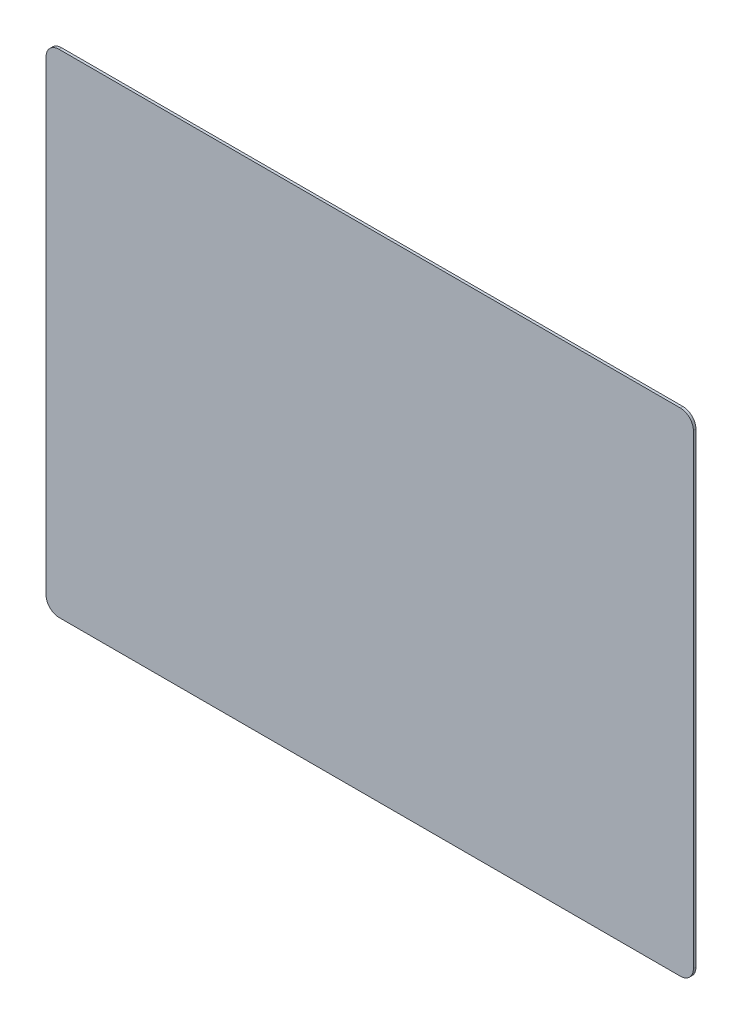
ISO-10303-21;
HEADER;
FILE_DESCRIPTION(('STEP AP214'),'2;1');
FILE_NAME('part.step','',(''),(''),'','','');
FILE_SCHEMA(('AUTOMOTIVE_DESIGN { 1 0 10303 214 1 1 1 1 }'));
ENDSEC;
DATA;
#1=APPLICATION_CONTEXT('core data for automotive mechanical design processes');
#2=APPLICATION_PROTOCOL_DEFINITION('international standard','automotive_design',2000,#1);
#3=PRODUCT_CONTEXT('',#1,'mechanical');
#4=PRODUCT('Part','Part','',(#3));
#5=PRODUCT_RELATED_PRODUCT_CATEGORY('part','',(#4));
#6=PRODUCT_DEFINITION_FORMATION('','',#4);
#7=PRODUCT_DEFINITION_CONTEXT('part definition',#1,'design');
#8=PRODUCT_DEFINITION('design','',#6,#7);
#9=PRODUCT_DEFINITION_SHAPE('','',#8);
#10=(LENGTH_UNIT() NAMED_UNIT(*) SI_UNIT(.MILLI.,.METRE.));
#11=(NAMED_UNIT(*) PLANE_ANGLE_UNIT() SI_UNIT($,.RADIAN.));
#12=(NAMED_UNIT(*) SI_UNIT($,.STERADIAN.) SOLID_ANGLE_UNIT());
#13=UNCERTAINTY_MEASURE_WITH_UNIT(LENGTH_MEASURE(1.E-05),#10,'distance_accuracy_value','');
#14=(GEOMETRIC_REPRESENTATION_CONTEXT(3) GLOBAL_UNCERTAINTY_ASSIGNED_CONTEXT((#13)) GLOBAL_UNIT_ASSIGNED_CONTEXT((#10,
#11,#12)) REPRESENTATION_CONTEXT('',''));
#15=CARTESIAN_POINT('',(0.,0.,0.));
#16=DIRECTION('',(0.,0.,1.));
#17=DIRECTION('',(1.,0.,0.));
#18=AXIS2_PLACEMENT_3D('',#15,#16,#17);
#19=CARTESIAN_POINT('',(498.5,-379.,4.));
#20=DIRECTION('',(-1.,0.,0.));
#21=DIRECTION('',(0.,0.,1.));
#22=AXIS2_PLACEMENT_3D('',#19,#20,#21);
#23=PLANE('',#22);
#24=DIRECTION('',(0.,1.,0.));
#25=VECTOR('',#24,1.);
#26=CARTESIAN_POINT('',(498.5,-379.,0.));
#27=LINE('',#26,#25);
#28=CARTESIAN_POINT('',(498.5,-359.,0.));
#29=VERTEX_POINT('',#28);
#30=CARTESIAN_POINT('',(498.5,359.,0.));
#31=VERTEX_POINT('',#30);
#32=EDGE_CURVE('E157',#29,#31,#27,.T.);
#33=ORIENTED_EDGE('',*,*,#32,.T.);
#34=DIRECTION('',(0.,0.,-1.));
#35=VECTOR('',#34,1.);
#36=CARTESIAN_POINT('',(498.5,359.,4.));
#37=LINE('',#36,#35);
#38=CARTESIAN_POINT('',(498.5,359.,4.));
#39=VERTEX_POINT('',#38);
#40=EDGE_CURVE('E11',#31,#39,#37,.F.);
#41=ORIENTED_EDGE('',*,*,#40,.T.);
#42=DIRECTION('',(0.,1.,0.));
#43=VECTOR('',#42,1.);
#44=CARTESIAN_POINT('',(498.5,-379.,4.));
#45=LINE('',#44,#43);
#46=CARTESIAN_POINT('',(498.5,-359.,4.));
#47=VERTEX_POINT('',#46);
#48=EDGE_CURVE('E125',#47,#39,#45,.T.);
#49=ORIENTED_EDGE('',*,*,#48,.F.);
#50=DIRECTION('',(0.,0.,-1.));
#51=VECTOR('',#50,1.);
#52=CARTESIAN_POINT('',(498.5,-359.,4.));
#53=LINE('',#52,#51);
#54=EDGE_CURVE('E41',#47,#29,#53,.T.);
#55=ORIENTED_EDGE('',*,*,#54,.T.);
#56=EDGE_LOOP('',(#33,#41,#49,#55));
#57=FACE_BOUND('',#56,.T.);
#58=ADVANCED_FACE('F33',(#57),#23,.F.);
#59=CARTESIAN_POINT('',(-498.5,379.,4.));
#60=DIRECTION('',(0.,-1.,0.));
#61=DIRECTION('',(0.,0.,-1.));
#62=AXIS2_PLACEMENT_3D('',#59,#60,#61);
#63=PLANE('',#62);
#64=DIRECTION('',(-1.,0.,0.));
#65=VECTOR('',#64,1.);
#66=CARTESIAN_POINT('',(-498.5,379.,0.));
#67=LINE('',#66,#65);
#68=CARTESIAN_POINT('',(478.5,379.,0.));
#69=VERTEX_POINT('',#68);
#70=CARTESIAN_POINT('',(-478.5,379.,0.));
#71=VERTEX_POINT('',#70);
#72=EDGE_CURVE('E130',#69,#71,#67,.T.);
#73=ORIENTED_EDGE('',*,*,#72,.T.);
#74=DIRECTION('',(0.,0.,-1.));
#75=VECTOR('',#74,1.);
#76=CARTESIAN_POINT('',(-478.5,379.,4.));
#77=LINE('',#76,#75);
#78=CARTESIAN_POINT('',(-478.5,379.,4.));
#79=VERTEX_POINT('',#78);
#80=EDGE_CURVE('E48',#71,#79,#77,.F.);
#81=ORIENTED_EDGE('',*,*,#80,.T.);
#82=DIRECTION('',(-1.,0.,0.));
#83=VECTOR('',#82,1.);
#84=CARTESIAN_POINT('',(-498.5,379.,4.));
#85=LINE('',#84,#83);
#86=CARTESIAN_POINT('',(478.5,379.,4.));
#87=VERTEX_POINT('',#86);
#88=EDGE_CURVE('E128',#87,#79,#85,.T.);
#89=ORIENTED_EDGE('',*,*,#88,.F.);
#90=DIRECTION('',(0.,0.,-1.));
#91=VECTOR('',#90,1.);
#92=CARTESIAN_POINT('',(478.5,379.,4.));
#93=LINE('',#92,#91);
#94=EDGE_CURVE('E149',#87,#69,#93,.T.);
#95=ORIENTED_EDGE('',*,*,#94,.T.);
#96=EDGE_LOOP('',(#73,#81,#89,#95));
#97=FACE_BOUND('',#96,.T.);
#98=ADVANCED_FACE('F177',(#97),#63,.F.);
#99=CARTESIAN_POINT('',(-498.5,-379.,4.));
#100=DIRECTION('',(1.,0.,0.));
#101=DIRECTION('',(0.,0.,-1.));
#102=AXIS2_PLACEMENT_3D('',#99,#100,#101);
#103=PLANE('',#102);
#104=DIRECTION('',(0.,-1.,0.));
#105=VECTOR('',#104,1.);
#106=CARTESIAN_POINT('',(-498.5,-379.,0.));
#107=LINE('',#106,#105);
#108=CARTESIAN_POINT('',(-498.5,359.,0.));
#109=VERTEX_POINT('',#108);
#110=CARTESIAN_POINT('',(-498.5,-359.,0.));
#111=VERTEX_POINT('',#110);
#112=EDGE_CURVE('E126',#109,#111,#107,.T.);
#113=ORIENTED_EDGE('',*,*,#112,.T.);
#114=DIRECTION('',(0.,0.,-1.));
#115=VECTOR('',#114,1.);
#116=CARTESIAN_POINT('',(-498.5,-359.,4.));
#117=LINE('',#116,#115);
#118=CARTESIAN_POINT('',(-498.5,-359.,4.));
#119=VERTEX_POINT('',#118);
#120=EDGE_CURVE('E104',#111,#119,#117,.F.);
#121=ORIENTED_EDGE('',*,*,#120,.T.);
#122=DIRECTION('',(0.,-1.,0.));
#123=VECTOR('',#122,1.);
#124=CARTESIAN_POINT('',(-498.5,-379.,4.));
#125=LINE('',#124,#123);
#126=CARTESIAN_POINT('',(-498.5,359.,4.));
#127=VERTEX_POINT('',#126);
#128=EDGE_CURVE('E165',#127,#119,#125,.T.);
#129=ORIENTED_EDGE('',*,*,#128,.F.);
#130=DIRECTION('',(0.,0.,-1.));
#131=VECTOR('',#130,1.);
#132=CARTESIAN_POINT('',(-498.5,359.,4.));
#133=LINE('',#132,#131);
#134=EDGE_CURVE('E109',#127,#109,#133,.T.);
#135=ORIENTED_EDGE('',*,*,#134,.T.);
#136=EDGE_LOOP('',(#113,#121,#129,#135));
#137=FACE_BOUND('',#136,.T.);
#138=ADVANCED_FACE('F176',(#137),#103,.F.);
#139=CARTESIAN_POINT('',(-498.5,-379.,4.));
#140=DIRECTION('',(0.,1.,0.));
#141=DIRECTION('',(0.,0.,1.));
#142=AXIS2_PLACEMENT_3D('',#139,#140,#141);
#143=PLANE('',#142);
#144=DIRECTION('',(1.,0.,0.));
#145=VECTOR('',#144,1.);
#146=CARTESIAN_POINT('',(-498.5,-379.,4.));
#147=LINE('',#146,#145);
#148=CARTESIAN_POINT('',(-478.5,-379.,4.));
#149=VERTEX_POINT('',#148);
#150=CARTESIAN_POINT('',(478.5,-379.,4.));
#151=VERTEX_POINT('',#150);
#152=EDGE_CURVE('E119',#149,#151,#147,.T.);
#153=ORIENTED_EDGE('',*,*,#152,.F.);
#154=DIRECTION('',(0.,0.,-1.));
#155=VECTOR('',#154,1.);
#156=CARTESIAN_POINT('',(-478.5,-379.,4.));
#157=LINE('',#156,#155);
#158=CARTESIAN_POINT('',(-478.5,-379.,0.));
#159=VERTEX_POINT('',#158);
#160=EDGE_CURVE('E103',#149,#159,#157,.T.);
#161=ORIENTED_EDGE('',*,*,#160,.T.);
#162=DIRECTION('',(1.,0.,0.));
#163=VECTOR('',#162,1.);
#164=CARTESIAN_POINT('',(-498.5,-379.,0.));
#165=LINE('',#164,#163);
#166=CARTESIAN_POINT('',(478.5,-379.,0.));
#167=VERTEX_POINT('',#166);
#168=EDGE_CURVE('E116',#159,#167,#165,.T.);
#169=ORIENTED_EDGE('',*,*,#168,.T.);
#170=DIRECTION('',(0.,0.,-1.));
#171=VECTOR('',#170,1.);
#172=CARTESIAN_POINT('',(478.5,-379.,4.));
#173=LINE('',#172,#171);
#174=EDGE_CURVE('E121',#167,#151,#173,.F.);
#175=ORIENTED_EDGE('',*,*,#174,.T.);
#176=EDGE_LOOP('',(#153,#161,#169,#175));
#177=FACE_BOUND('',#176,.T.);
#178=ADVANCED_FACE('F115',(#177),#143,.F.);
#179=CARTESIAN_POINT('',(0.,0.,4.));
#180=DIRECTION('',(0.,0.,-1.));
#181=DIRECTION('',(-1.,0.,0.));
#182=AXIS2_PLACEMENT_3D('',#179,#180,#181);
#183=PLANE('',#182);
#184=ORIENTED_EDGE('',*,*,#128,.T.);
#185=CARTESIAN_POINT('',(-478.5,-359.,4.));
#186=DIRECTION('',(0.,0.,-1.));
#187=DIRECTION('',(-1.,0.,0.));
#188=AXIS2_PLACEMENT_3D('',#185,#186,#187);
#189=CIRCLE('',#188,20.);
#190=EDGE_CURVE('E147',#119,#149,#189,.F.);
#191=ORIENTED_EDGE('',*,*,#190,.T.);
#192=ORIENTED_EDGE('',*,*,#152,.T.);
#193=CARTESIAN_POINT('',(478.5,-359.,4.));
#194=DIRECTION('',(0.,0.,-1.));
#195=DIRECTION('',(-1.,0.,0.));
#196=AXIS2_PLACEMENT_3D('',#193,#194,#195);
#197=CIRCLE('',#196,20.);
#198=EDGE_CURVE('E142',#151,#47,#197,.F.);
#199=ORIENTED_EDGE('',*,*,#198,.T.);
#200=ORIENTED_EDGE('',*,*,#48,.T.);
#201=CARTESIAN_POINT('',(478.5,359.,4.));
#202=DIRECTION('',(0.,0.,-1.));
#203=DIRECTION('',(-1.,0.,0.));
#204=AXIS2_PLACEMENT_3D('',#201,#202,#203);
#205=CIRCLE('',#204,20.);
#206=EDGE_CURVE('E55',#39,#87,#205,.F.);
#207=ORIENTED_EDGE('',*,*,#206,.T.);
#208=ORIENTED_EDGE('',*,*,#88,.T.);
#209=CARTESIAN_POINT('',(-478.5,359.,4.));
#210=DIRECTION('',(0.,0.,-1.));
#211=DIRECTION('',(-1.,0.,0.));
#212=AXIS2_PLACEMENT_3D('',#209,#210,#211);
#213=CIRCLE('',#212,20.);
#214=EDGE_CURVE('E145',#79,#127,#213,.F.);
#215=ORIENTED_EDGE('',*,*,#214,.T.);
#216=EDGE_LOOP('',(#184,#191,#192,#199,#200,#207,#208,#215));
#217=FACE_BOUND('',#216,.T.);
#218=ADVANCED_FACE('F169',(#217),#183,.F.);
#219=CARTESIAN_POINT('',(0.,0.,0.));
#220=DIRECTION('',(0.,0.,-1.));
#221=DIRECTION('',(-1.,0.,0.));
#222=AXIS2_PLACEMENT_3D('',#219,#220,#221);
#223=PLANE('',#222);
#224=ORIENTED_EDGE('',*,*,#168,.F.);
#225=CARTESIAN_POINT('',(-478.5,-359.,0.));
#226=DIRECTION('',(0.,0.,-1.));
#227=DIRECTION('',(-1.,0.,0.));
#228=AXIS2_PLACEMENT_3D('',#225,#226,#227);
#229=CIRCLE('',#228,20.);
#230=EDGE_CURVE('E99',#159,#111,#229,.T.);
#231=ORIENTED_EDGE('',*,*,#230,.T.);
#232=ORIENTED_EDGE('',*,*,#112,.F.);
#233=CARTESIAN_POINT('',(-478.5,359.,0.));
#234=DIRECTION('',(0.,0.,-1.));
#235=DIRECTION('',(-1.,0.,0.));
#236=AXIS2_PLACEMENT_3D('',#233,#234,#235);
#237=CIRCLE('',#236,20.);
#238=EDGE_CURVE('E110',#109,#71,#237,.T.);
#239=ORIENTED_EDGE('',*,*,#238,.T.);
#240=ORIENTED_EDGE('',*,*,#72,.F.);
#241=CARTESIAN_POINT('',(478.5,359.,0.));
#242=DIRECTION('',(0.,0.,-1.));
#243=DIRECTION('',(-1.,0.,0.));
#244=AXIS2_PLACEMENT_3D('',#241,#242,#243);
#245=CIRCLE('',#244,20.);
#246=EDGE_CURVE('E136',#69,#31,#245,.T.);
#247=ORIENTED_EDGE('',*,*,#246,.T.);
#248=ORIENTED_EDGE('',*,*,#32,.F.);
#249=CARTESIAN_POINT('',(478.5,-359.,0.));
#250=DIRECTION('',(0.,0.,-1.));
#251=DIRECTION('',(-1.,0.,0.));
#252=AXIS2_PLACEMENT_3D('',#249,#250,#251);
#253=CIRCLE('',#252,20.);
#254=EDGE_CURVE('E120',#29,#167,#253,.T.);
#255=ORIENTED_EDGE('',*,*,#254,.T.);
#256=EDGE_LOOP('',(#224,#231,#232,#239,#240,#247,#248,#255));
#257=FACE_BOUND('',#256,.T.);
#258=ADVANCED_FACE('F123',(#257),#223,.T.);
#259=CARTESIAN_POINT('',(-478.5,-359.,4.));
#260=DIRECTION('',(0.,0.,-1.));
#261=DIRECTION('',(-1.,0.,0.));
#262=AXIS2_PLACEMENT_3D('',#259,#260,#261);
#263=CYLINDRICAL_SURFACE('',#262,20.);
#264=ORIENTED_EDGE('',*,*,#190,.F.);
#265=ORIENTED_EDGE('',*,*,#120,.F.);
#266=ORIENTED_EDGE('',*,*,#230,.F.);
#267=ORIENTED_EDGE('',*,*,#160,.F.);
#268=EDGE_LOOP('',(#264,#265,#266,#267));
#269=FACE_BOUND('',#268,.T.);
#270=ADVANCED_FACE('F102',(#269),#263,.T.);
#271=CARTESIAN_POINT('',(-478.5,359.,4.));
#272=DIRECTION('',(0.,0.,-1.));
#273=DIRECTION('',(-1.,0.,0.));
#274=AXIS2_PLACEMENT_3D('',#271,#272,#273);
#275=CYLINDRICAL_SURFACE('',#274,20.);
#276=ORIENTED_EDGE('',*,*,#214,.F.);
#277=ORIENTED_EDGE('',*,*,#80,.F.);
#278=ORIENTED_EDGE('',*,*,#238,.F.);
#279=ORIENTED_EDGE('',*,*,#134,.F.);
#280=EDGE_LOOP('',(#276,#277,#278,#279));
#281=FACE_BOUND('',#280,.T.);
#282=ADVANCED_FACE('F174',(#281),#275,.T.);
#283=CARTESIAN_POINT('',(478.5,359.,4.));
#284=DIRECTION('',(0.,0.,-1.));
#285=DIRECTION('',(-1.,0.,0.));
#286=AXIS2_PLACEMENT_3D('',#283,#284,#285);
#287=CYLINDRICAL_SURFACE('',#286,20.);
#288=ORIENTED_EDGE('',*,*,#206,.F.);
#289=ORIENTED_EDGE('',*,*,#40,.F.);
#290=ORIENTED_EDGE('',*,*,#246,.F.);
#291=ORIENTED_EDGE('',*,*,#94,.F.);
#292=EDGE_LOOP('',(#288,#289,#290,#291));
#293=FACE_BOUND('',#292,.T.);
#294=ADVANCED_FACE('F179',(#293),#287,.T.);
#295=CARTESIAN_POINT('',(478.5,-359.,4.));
#296=DIRECTION('',(0.,0.,-1.));
#297=DIRECTION('',(-1.,0.,0.));
#298=AXIS2_PLACEMENT_3D('',#295,#296,#297);
#299=CYLINDRICAL_SURFACE('',#298,20.);
#300=ORIENTED_EDGE('',*,*,#198,.F.);
#301=ORIENTED_EDGE('',*,*,#174,.F.);
#302=ORIENTED_EDGE('',*,*,#254,.F.);
#303=ORIENTED_EDGE('',*,*,#54,.F.);
#304=EDGE_LOOP('',(#300,#301,#302,#303));
#305=FACE_BOUND('',#304,.T.);
#306=ADVANCED_FACE('F35',(#305),#299,.T.);
#307=CLOSED_SHELL('',(#58,#98,#138,#178,#218,#258,#270,#282,#294,#306));
#308=MANIFOLD_SOLID_BREP('B2',#307);
#309=ADVANCED_BREP_SHAPE_REPRESENTATION('',(#18,#308),#14);
#310=SHAPE_DEFINITION_REPRESENTATION(#9,#309);
ENDSEC;
END-ISO-10303-21;
